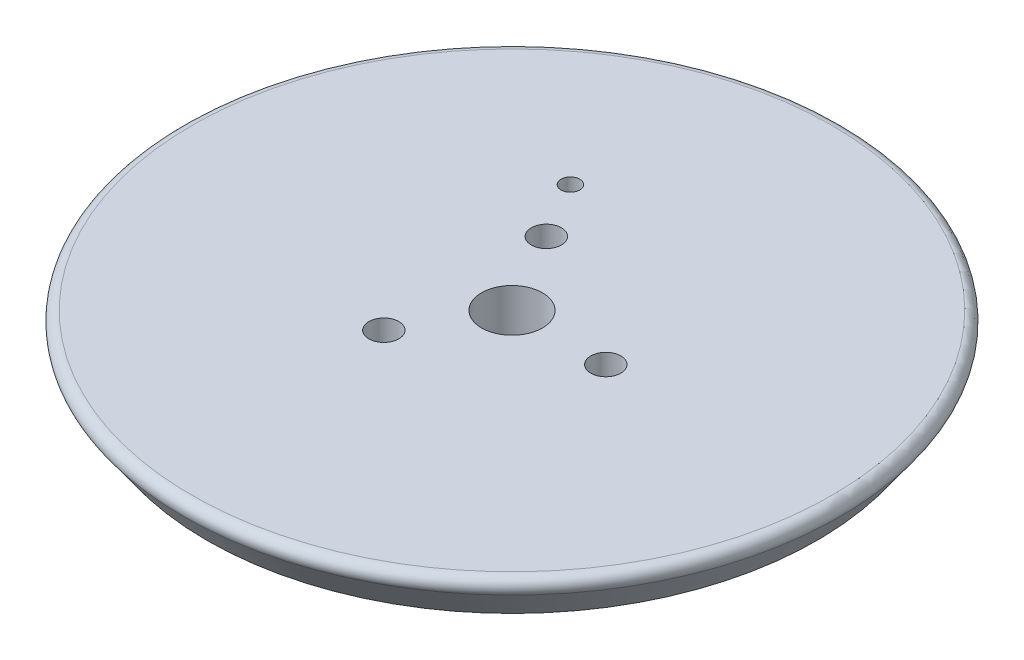
ISO-10303-21;
HEADER;
FILE_DESCRIPTION(('STEP AP214'),'2;1');
FILE_NAME('part.step','',(''),(''),'','','');
FILE_SCHEMA(('AUTOMOTIVE_DESIGN { 1 0 10303 214 1 1 1 1 }'));
ENDSEC;
DATA;
#1=APPLICATION_CONTEXT('core data for automotive mechanical design processes');
#2=APPLICATION_PROTOCOL_DEFINITION('international standard','automotive_design',2000,#1);
#3=PRODUCT_CONTEXT('',#1,'mechanical');
#4=PRODUCT('Part','Part','',(#3));
#5=PRODUCT_RELATED_PRODUCT_CATEGORY('part','',(#4));
#6=PRODUCT_DEFINITION_FORMATION('','',#4);
#7=PRODUCT_DEFINITION_CONTEXT('part definition',#1,'design');
#8=PRODUCT_DEFINITION('design','',#6,#7);
#9=PRODUCT_DEFINITION_SHAPE('','',#8);
#10=(LENGTH_UNIT() NAMED_UNIT(*) SI_UNIT(.MILLI.,.METRE.));
#11=(NAMED_UNIT(*) PLANE_ANGLE_UNIT() SI_UNIT($,.RADIAN.));
#12=(NAMED_UNIT(*) SI_UNIT($,.STERADIAN.) SOLID_ANGLE_UNIT());
#13=UNCERTAINTY_MEASURE_WITH_UNIT(LENGTH_MEASURE(1.E-05),#10,'distance_accuracy_value','');
#14=(GEOMETRIC_REPRESENTATION_CONTEXT(3) GLOBAL_UNCERTAINTY_ASSIGNED_CONTEXT((#13)) GLOBAL_UNIT_ASSIGNED_CONTEXT((#10,
#11,#12)) REPRESENTATION_CONTEXT('',''));
#15=CARTESIAN_POINT('',(0.,0.,0.));
#16=DIRECTION('',(0.,0.,1.));
#17=DIRECTION('',(1.,0.,0.));
#18=AXIS2_PLACEMENT_3D('',#15,#16,#17);
#19=CARTESIAN_POINT('',(0.,0.,0.));
#20=DIRECTION('',(0.,-1.,0.));
#21=DIRECTION('',(0.,0.,-1.));
#22=AXIS2_PLACEMENT_3D('',#19,#20,#21);
#23=PLANE('',#22);
#24=CARTESIAN_POINT('',(-8.5,0.,-14.7224318643355));
#25=DIRECTION('',(0.,1.,0.));
#26=DIRECTION('',(0.,0.,1.));
#27=AXIS2_PLACEMENT_3D('',#24,#25,#26);
#28=CIRCLE('',#27,1.);
#29=CARTESIAN_POINT('',(-8.5,0.,-13.7224318643355));
#30=VERTEX_POINT('',#29);
#31=EDGE_CURVE('E67',#30,#30,#28,.T.);
#32=ORIENTED_EDGE('',*,*,#31,.F.);
#33=EDGE_LOOP('',(#32));
#34=FACE_BOUND('',#33,.T.);
#35=CARTESIAN_POINT('',(-4.99999999999992,0.,-8.66025403784443));
#36=DIRECTION('',(0.,1.,0.));
#37=DIRECTION('',(0.,0.,1.));
#38=AXIS2_PLACEMENT_3D('',#35,#36,#37);
#39=CIRCLE('',#38,1.6);
#40=CARTESIAN_POINT('',(-4.99999999999992,0.,-7.06025403784443));
#41=VERTEX_POINT('',#40);
#42=EDGE_CURVE('E66',#41,#41,#39,.T.);
#43=ORIENTED_EDGE('',*,*,#42,.F.);
#44=EDGE_LOOP('',(#43));
#45=FACE_BOUND('',#44,.T.);
#46=CARTESIAN_POINT('',(-5.00000000000004,0.,8.66025403784437));
#47=DIRECTION('',(0.,1.,0.));
#48=DIRECTION('',(0.,0.,1.));
#49=AXIS2_PLACEMENT_3D('',#46,#47,#48);
#50=CIRCLE('',#49,1.6);
#51=CARTESIAN_POINT('',(-5.00000000000004,0.,10.2602540378444));
#52=VERTEX_POINT('',#51);
#53=EDGE_CURVE('E73',#52,#52,#50,.T.);
#54=ORIENTED_EDGE('',*,*,#53,.F.);
#55=EDGE_LOOP('',(#54));
#56=FACE_BOUND('',#55,.T.);
#57=CARTESIAN_POINT('',(10.,0.,0.));
#58=DIRECTION('',(0.,1.,0.));
#59=DIRECTION('',(0.,0.,1.));
#60=AXIS2_PLACEMENT_3D('',#57,#58,#59);
#61=CIRCLE('',#60,1.6);
#62=CARTESIAN_POINT('',(10.,0.,1.6));
#63=VERTEX_POINT('',#62);
#64=EDGE_CURVE('E79',#63,#63,#61,.T.);
#65=ORIENTED_EDGE('',*,*,#64,.F.);
#66=EDGE_LOOP('',(#65));
#67=FACE_BOUND('',#66,.T.);
#68=CARTESIAN_POINT('',(0.,0.,0.));
#69=DIRECTION('',(0.,1.,0.));
#70=DIRECTION('',(0.,0.,1.));
#71=AXIS2_PLACEMENT_3D('',#68,#69,#70);
#72=CIRCLE('',#71,3.25);
#73=CARTESIAN_POINT('',(0.,0.,3.25));
#74=VERTEX_POINT('',#73);
#75=EDGE_CURVE('E59',#74,#74,#72,.T.);
#76=ORIENTED_EDGE('',*,*,#75,.F.);
#77=EDGE_LOOP('',(#76));
#78=FACE_BOUND('',#77,.T.);
#79=CARTESIAN_POINT('',(0.,0.,0.));
#80=DIRECTION('',(0.,-1.,0.));
#81=DIRECTION('',(0.,0.,-1.));
#82=AXIS2_PLACEMENT_3D('',#79,#80,#81);
#83=CIRCLE('',#82,34.1284485110491);
#84=CARTESIAN_POINT('',(0.,0.,-34.1284485110491));
#85=VERTEX_POINT('',#84);
#86=EDGE_CURVE('E37',#85,#85,#83,.F.);
#87=ORIENTED_EDGE('',*,*,#86,.T.);
#88=EDGE_LOOP('',(#87));
#89=FACE_BOUND('',#88,.T.);
#90=ADVANCED_FACE('F30',(#34,#45,#56,#67,#78,#89),#23,.F.);
#91=CARTESIAN_POINT('',(0.,-5.,0.));
#92=DIRECTION('',(0.,1.,0.));
#93=DIRECTION('',(0.,0.,1.));
#94=AXIS2_PLACEMENT_3D('',#91,#92,#93);
#95=CONICAL_SURFACE('',#94,32.5,0.620290016158789);
#96=CARTESIAN_POINT('',(0.,-1.58127117400246,0.));
#97=DIRECTION('',(0.,-1.,0.));
#98=DIRECTION('',(0.,0.,-1.));
#99=AXIS2_PLACEMENT_3D('',#96,#97,#98);
#100=CIRCLE('',#99,34.9421584239012);
#101=CARTESIAN_POINT('',(0.,-1.58127117400246,-34.9421584239012));
#102=VERTEX_POINT('',#101);
#103=EDGE_CURVE('E10',#102,#102,#100,.T.);
#104=ORIENTED_EDGE('',*,*,#103,.T.);
#105=EDGE_LOOP('',(#104));
#106=FACE_BOUND('',#105,.T.);
#107=CARTESIAN_POINT('',(0.,-5.,0.));
#108=DIRECTION('',(0.,1.,0.));
#109=DIRECTION('',(0.,0.,1.));
#110=AXIS2_PLACEMENT_3D('',#107,#108,#109);
#111=CIRCLE('',#110,32.5);
#112=CARTESIAN_POINT('',(0.,-5.,32.5));
#113=VERTEX_POINT('',#112);
#114=EDGE_CURVE('E41',#113,#113,#111,.T.);
#115=ORIENTED_EDGE('',*,*,#114,.T.);
#116=EDGE_LOOP('',(#115));
#117=FACE_BOUND('',#116,.T.);
#118=ADVANCED_FACE('F92',(#106,#117),#95,.T.);
#119=CARTESIAN_POINT('',(32.5,-4.99999999999999,0.));
#120=DIRECTION('',(0.,1.,0.));
#121=DIRECTION('',(0.,0.,1.));
#122=AXIS2_PLACEMENT_3D('',#119,#120,#121);
#123=PLANE('',#122);
#124=CARTESIAN_POINT('',(-8.5,-4.99999999999999,-14.7224318643355));
#125=DIRECTION('',(0.,1.,0.));
#126=DIRECTION('',(0.,0.,1.));
#127=AXIS2_PLACEMENT_3D('',#124,#125,#126);
#128=CIRCLE('',#127,1.);
#129=CARTESIAN_POINT('',(-8.5,-4.99999999999999,-13.7224318643355));
#130=VERTEX_POINT('',#129);
#131=EDGE_CURVE('E63',#130,#130,#128,.F.);
#132=ORIENTED_EDGE('',*,*,#131,.F.);
#133=EDGE_LOOP('',(#132));
#134=FACE_BOUND('',#133,.T.);
#135=ORIENTED_EDGE('',*,*,#114,.F.);
#136=EDGE_LOOP('',(#135));
#137=FACE_BOUND('',#136,.T.);
#138=CARTESIAN_POINT('',(0.,-4.99999999999998,0.));
#139=DIRECTION('',(0.,1.,0.));
#140=DIRECTION('',(0.,0.,1.));
#141=AXIS2_PLACEMENT_3D('',#138,#139,#140);
#142=CIRCLE('',#141,15.);
#143=CARTESIAN_POINT('',(0.,-4.99999999999998,15.));
#144=VERTEX_POINT('',#143);
#145=EDGE_CURVE('E45',#144,#144,#142,.T.);
#146=ORIENTED_EDGE('',*,*,#145,.T.);
#147=EDGE_LOOP('',(#146));
#148=FACE_BOUND('',#147,.T.);
#149=ADVANCED_FACE('F121',(#134,#137,#148),#123,.F.);
#150=CARTESIAN_POINT('',(0.,33.1662870159453,0.));
#151=DIRECTION('',(0.,1.,0.));
#152=DIRECTION('',(0.,0.,1.));
#153=AXIS2_PLACEMENT_3D('',#150,#151,#152);
#154=CYLINDRICAL_SURFACE('',#153,15.);
#155=ORIENTED_EDGE('',*,*,#145,.F.);
#156=EDGE_LOOP('',(#155));
#157=FACE_BOUND('',#156,.T.);
#158=CARTESIAN_POINT('',(0.,-6.39999999999998,0.));
#159=DIRECTION('',(0.,1.,0.));
#160=DIRECTION('',(0.,0.,1.));
#161=AXIS2_PLACEMENT_3D('',#158,#159,#160);
#162=CIRCLE('',#161,15.);
#163=CARTESIAN_POINT('',(0.,-6.39999999999998,15.));
#164=VERTEX_POINT('',#163);
#165=EDGE_CURVE('E50',#164,#164,#162,.T.);
#166=ORIENTED_EDGE('',*,*,#165,.T.);
#167=EDGE_LOOP('',(#166));
#168=FACE_BOUND('',#167,.T.);
#169=ADVANCED_FACE('F113',(#157,#168),#154,.T.);
#170=CARTESIAN_POINT('',(15.,-6.39999999999999,0.));
#171=DIRECTION('',(0.,1.,0.));
#172=DIRECTION('',(0.,0.,1.));
#173=AXIS2_PLACEMENT_3D('',#170,#171,#172);
#174=PLANE('',#173);
#175=CARTESIAN_POINT('',(-4.99999999999992,-6.39999999999999,-8.66025403784443));
#176=DIRECTION('',(0.,1.,0.));
#177=DIRECTION('',(0.,0.,1.));
#178=AXIS2_PLACEMENT_3D('',#175,#176,#177);
#179=CIRCLE('',#178,1.6);
#180=CARTESIAN_POINT('',(-4.99999999999992,-6.39999999999999,-7.06025403784443));
#181=VERTEX_POINT('',#180);
#182=EDGE_CURVE('E70',#181,#181,#179,.F.);
#183=ORIENTED_EDGE('',*,*,#182,.F.);
#184=EDGE_LOOP('',(#183));
#185=FACE_BOUND('',#184,.T.);
#186=CARTESIAN_POINT('',(-5.00000000000004,-6.39999999999999,8.66025403784437));
#187=DIRECTION('',(0.,1.,0.));
#188=DIRECTION('',(0.,0.,1.));
#189=AXIS2_PLACEMENT_3D('',#186,#187,#188);
#190=CIRCLE('',#189,1.6);
#191=CARTESIAN_POINT('',(-5.00000000000004,-6.39999999999999,10.2602540378444));
#192=VERTEX_POINT('',#191);
#193=EDGE_CURVE('E76',#192,#192,#190,.F.);
#194=ORIENTED_EDGE('',*,*,#193,.F.);
#195=EDGE_LOOP('',(#194));
#196=FACE_BOUND('',#195,.T.);
#197=CARTESIAN_POINT('',(10.,-6.39999999999999,0.));
#198=DIRECTION('',(0.,1.,0.));
#199=DIRECTION('',(0.,0.,1.));
#200=AXIS2_PLACEMENT_3D('',#197,#198,#199);
#201=CIRCLE('',#200,1.6);
#202=CARTESIAN_POINT('',(10.,-6.39999999999999,1.6));
#203=VERTEX_POINT('',#202);
#204=EDGE_CURVE('E62',#203,#203,#201,.F.);
#205=ORIENTED_EDGE('',*,*,#204,.F.);
#206=EDGE_LOOP('',(#205));
#207=FACE_BOUND('',#206,.T.);
#208=ORIENTED_EDGE('',*,*,#165,.F.);
#209=EDGE_LOOP('',(#208));
#210=FACE_BOUND('',#209,.T.);
#211=CARTESIAN_POINT('',(0.,-6.39999999999999,0.));
#212=DIRECTION('',(0.,1.,0.));
#213=DIRECTION('',(0.,0.,1.));
#214=AXIS2_PLACEMENT_3D('',#211,#212,#213);
#215=CIRCLE('',#214,5.25);
#216=CARTESIAN_POINT('',(0.,-6.39999999999999,5.25));
#217=VERTEX_POINT('',#216);
#218=EDGE_CURVE('E53',#217,#217,#215,.T.);
#219=ORIENTED_EDGE('',*,*,#218,.T.);
#220=EDGE_LOOP('',(#219));
#221=FACE_BOUND('',#220,.T.);
#222=ADVANCED_FACE('F104',(#185,#196,#207,#210,#221),#174,.F.);
#223=CARTESIAN_POINT('',(0.,-8.39999999999998,0.));
#224=DIRECTION('',(0.,1.,0.));
#225=DIRECTION('',(0.,0.,1.));
#226=AXIS2_PLACEMENT_3D('',#223,#224,#225);
#227=CONICAL_SURFACE('',#226,3.25000000000001,0.785398163397448);
#228=ORIENTED_EDGE('',*,*,#218,.F.);
#229=EDGE_LOOP('',(#228));
#230=FACE_BOUND('',#229,.T.);
#231=CARTESIAN_POINT('',(0.,-8.39999999999999,0.));
#232=DIRECTION('',(0.,1.,0.));
#233=DIRECTION('',(0.,0.,1.));
#234=AXIS2_PLACEMENT_3D('',#231,#232,#233);
#235=CIRCLE('',#234,3.25);
#236=CARTESIAN_POINT('',(0.,-8.39999999999999,3.25));
#237=VERTEX_POINT('',#236);
#238=EDGE_CURVE('E56',#237,#237,#235,.F.);
#239=ORIENTED_EDGE('',*,*,#238,.F.);
#240=EDGE_LOOP('',(#239));
#241=FACE_BOUND('',#240,.T.);
#242=ADVANCED_FACE('F102',(#230,#241),#227,.T.);
#243=CARTESIAN_POINT('',(0.,-1.,0.));
#244=DIRECTION('',(0.,-1.,0.));
#245=DIRECTION('',(0.,0.,-1.));
#246=AXIS2_PLACEMENT_3D('',#243,#244,#245);
#247=TOROIDAL_SURFACE('',#246,34.1284485110491,1.);
#248=ORIENTED_EDGE('',*,*,#103,.F.);
#249=EDGE_LOOP('',(#248));
#250=FACE_BOUND('',#249,.T.);
#251=ORIENTED_EDGE('',*,*,#86,.F.);
#252=EDGE_LOOP('',(#251));
#253=FACE_BOUND('',#252,.T.);
#254=ADVANCED_FACE('F32',(#250,#253),#247,.T.);
#255=CARTESIAN_POINT('',(0.,-8.40099999999998,0.));
#256=DIRECTION('',(0.,1.,0.));
#257=DIRECTION('',(0.,0.,1.));
#258=AXIS2_PLACEMENT_3D('',#255,#256,#257);
#259=CYLINDRICAL_SURFACE('',#258,3.25);
#260=ORIENTED_EDGE('',*,*,#75,.T.);
#261=EDGE_LOOP('',(#260));
#262=FACE_BOUND('',#261,.T.);
#263=ORIENTED_EDGE('',*,*,#238,.T.);
#264=EDGE_LOOP('',(#263));
#265=FACE_BOUND('',#264,.T.);
#266=ADVANCED_FACE('F96',(#262,#265),#259,.F.);
#267=CARTESIAN_POINT('',(10.,-8.40099999999998,0.));
#268=DIRECTION('',(0.,1.,0.));
#269=DIRECTION('',(0.,0.,1.));
#270=AXIS2_PLACEMENT_3D('',#267,#268,#269);
#271=CYLINDRICAL_SURFACE('',#270,1.6);
#272=ORIENTED_EDGE('',*,*,#64,.T.);
#273=EDGE_LOOP('',(#272));
#274=FACE_BOUND('',#273,.T.);
#275=ORIENTED_EDGE('',*,*,#204,.T.);
#276=EDGE_LOOP('',(#275));
#277=FACE_BOUND('',#276,.T.);
#278=ADVANCED_FACE('F87',(#274,#277),#271,.F.);
#279=CARTESIAN_POINT('',(-5.00000000000004,-8.40099999999998,8.66025403784437));
#280=DIRECTION('',(0.,1.,0.));
#281=DIRECTION('',(0.,0.,1.));
#282=AXIS2_PLACEMENT_3D('',#279,#280,#281);
#283=CYLINDRICAL_SURFACE('',#282,1.6);
#284=ORIENTED_EDGE('',*,*,#53,.T.);
#285=EDGE_LOOP('',(#284));
#286=FACE_BOUND('',#285,.T.);
#287=ORIENTED_EDGE('',*,*,#193,.T.);
#288=EDGE_LOOP('',(#287));
#289=FACE_BOUND('',#288,.T.);
#290=ADVANCED_FACE('F172',(#286,#289),#283,.F.);
#291=CARTESIAN_POINT('',(-4.99999999999992,-8.40099999999998,-8.66025403784443));
#292=DIRECTION('',(0.,1.,0.));
#293=DIRECTION('',(0.,0.,1.));
#294=AXIS2_PLACEMENT_3D('',#291,#292,#293);
#295=CYLINDRICAL_SURFACE('',#294,1.6);
#296=ORIENTED_EDGE('',*,*,#42,.T.);
#297=EDGE_LOOP('',(#296));
#298=FACE_BOUND('',#297,.T.);
#299=ORIENTED_EDGE('',*,*,#182,.T.);
#300=EDGE_LOOP('',(#299));
#301=FACE_BOUND('',#300,.T.);
#302=ADVANCED_FACE('F181',(#298,#301),#295,.F.);
#303=CARTESIAN_POINT('',(-8.5,-8.40099999999998,-14.7224318643355));
#304=DIRECTION('',(0.,1.,0.));
#305=DIRECTION('',(0.,0.,1.));
#306=AXIS2_PLACEMENT_3D('',#303,#304,#305);
#307=CYLINDRICAL_SURFACE('',#306,1.);
#308=ORIENTED_EDGE('',*,*,#31,.T.);
#309=EDGE_LOOP('',(#308));
#310=FACE_BOUND('',#309,.T.);
#311=ORIENTED_EDGE('',*,*,#131,.T.);
#312=EDGE_LOOP('',(#311));
#313=FACE_BOUND('',#312,.T.);
#314=ADVANCED_FACE('F191',(#310,#313),#307,.F.);
#315=CLOSED_SHELL('',(#90,#118,#149,#169,#222,#242,#254,#266,#278,#290,#302,#314));
#316=MANIFOLD_SOLID_BREP('B2',#315);
#317=ADVANCED_BREP_SHAPE_REPRESENTATION('',(#18,#316),#14);
#318=SHAPE_DEFINITION_REPRESENTATION(#9,#317);
ENDSEC;
END-ISO-10303-21;
